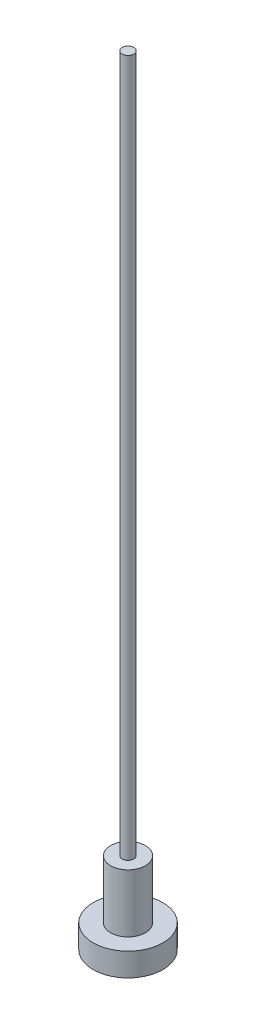
ISO-10303-21;
HEADER;
FILE_DESCRIPTION(('STEP AP214'),'2;1');
FILE_NAME('part.step','',(''),(''),'','','');
FILE_SCHEMA(('AUTOMOTIVE_DESIGN { 1 0 10303 214 1 1 1 1 }'));
ENDSEC;
DATA;
#1=APPLICATION_CONTEXT('core data for automotive mechanical design processes');
#2=APPLICATION_PROTOCOL_DEFINITION('international standard','automotive_design',2000,#1);
#3=PRODUCT_CONTEXT('',#1,'mechanical');
#4=PRODUCT('Part','Part','',(#3));
#5=PRODUCT_RELATED_PRODUCT_CATEGORY('part','',(#4));
#6=PRODUCT_DEFINITION_FORMATION('','',#4);
#7=PRODUCT_DEFINITION_CONTEXT('part definition',#1,'design');
#8=PRODUCT_DEFINITION('design','',#6,#7);
#9=PRODUCT_DEFINITION_SHAPE('','',#8);
#10=(LENGTH_UNIT() NAMED_UNIT(*) SI_UNIT(.MILLI.,.METRE.));
#11=(NAMED_UNIT(*) PLANE_ANGLE_UNIT() SI_UNIT($,.RADIAN.));
#12=(NAMED_UNIT(*) SI_UNIT($,.STERADIAN.) SOLID_ANGLE_UNIT());
#13=UNCERTAINTY_MEASURE_WITH_UNIT(LENGTH_MEASURE(1.E-05),#10,'distance_accuracy_value','');
#14=(GEOMETRIC_REPRESENTATION_CONTEXT(3) GLOBAL_UNCERTAINTY_ASSIGNED_CONTEXT((#13)) GLOBAL_UNIT_ASSIGNED_CONTEXT((#10,
#11,#12)) REPRESENTATION_CONTEXT('',''));
#15=CARTESIAN_POINT('',(0.,0.,0.));
#16=DIRECTION('',(0.,0.,1.));
#17=DIRECTION('',(1.,0.,0.));
#18=AXIS2_PLACEMENT_3D('',#15,#16,#17);
#19=CARTESIAN_POINT('',(0.,5.,0.));
#20=DIRECTION('',(0.,-1.,0.));
#21=DIRECTION('',(0.,0.,-1.));
#22=AXIS2_PLACEMENT_3D('',#19,#20,#21);
#23=CYLINDRICAL_SURFACE('',#22,1.5);
#24=CARTESIAN_POINT('',(0.,5.,0.));
#25=DIRECTION('',(0.,1.,0.));
#26=DIRECTION('',(0.,0.,1.));
#27=AXIS2_PLACEMENT_3D('',#24,#25,#26);
#28=CIRCLE('',#27,1.5);
#29=CARTESIAN_POINT('',(0.,5.,1.5));
#30=VERTEX_POINT('',#29);
#31=EDGE_CURVE('E49',#30,#30,#28,.T.);
#32=ORIENTED_EDGE('',*,*,#31,.F.);
#33=EDGE_LOOP('',(#32));
#34=FACE_BOUND('',#33,.T.);
#35=CARTESIAN_POINT('',(0.,0.,0.));
#36=DIRECTION('',(0.,1.,0.));
#37=DIRECTION('',(0.,0.,1.));
#38=AXIS2_PLACEMENT_3D('',#35,#36,#37);
#39=CIRCLE('',#38,1.5);
#40=CARTESIAN_POINT('',(0.,0.,1.5));
#41=VERTEX_POINT('',#40);
#42=EDGE_CURVE('E44',#41,#41,#39,.T.);
#43=ORIENTED_EDGE('',*,*,#42,.T.);
#44=EDGE_LOOP('',(#43));
#45=FACE_BOUND('',#44,.T.);
#46=ADVANCED_FACE('F41',(#34,#45),#23,.T.);
#47=CARTESIAN_POINT('',(0.,5.,0.));
#48=DIRECTION('',(0.,1.,0.));
#49=DIRECTION('',(0.,0.,1.));
#50=AXIS2_PLACEMENT_3D('',#47,#48,#49);
#51=PLANE('',#50);
#52=CARTESIAN_POINT('',(0.,5.,0.));
#53=DIRECTION('',(0.,1.,0.));
#54=DIRECTION('',(0.,0.,1.));
#55=AXIS2_PLACEMENT_3D('',#52,#53,#54);
#56=CIRCLE('',#55,0.5);
#57=CARTESIAN_POINT('',(0.,5.,0.5));
#58=VERTEX_POINT('',#57);
#59=EDGE_CURVE('E10',#58,#58,#56,.T.);
#60=ORIENTED_EDGE('',*,*,#59,.F.);
#61=EDGE_LOOP('',(#60));
#62=FACE_BOUND('',#61,.T.);
#63=ORIENTED_EDGE('',*,*,#31,.T.);
#64=EDGE_LOOP('',(#63));
#65=FACE_BOUND('',#64,.T.);
#66=ADVANCED_FACE('F95',(#62,#65),#51,.T.);
#67=CARTESIAN_POINT('',(0.,65.,0.));
#68=DIRECTION('',(0.,-1.,0.));
#69=DIRECTION('',(0.,0.,-1.));
#70=AXIS2_PLACEMENT_3D('',#67,#68,#69);
#71=CYLINDRICAL_SURFACE('',#70,0.5);
#72=CARTESIAN_POINT('',(0.,65.,0.));
#73=DIRECTION('',(0.,1.,0.));
#74=DIRECTION('',(0.,0.,1.));
#75=AXIS2_PLACEMENT_3D('',#72,#73,#74);
#76=CIRCLE('',#75,0.5);
#77=CARTESIAN_POINT('',(0.,65.,0.5));
#78=VERTEX_POINT('',#77);
#79=EDGE_CURVE('E55',#78,#78,#76,.T.);
#80=ORIENTED_EDGE('',*,*,#79,.F.);
#81=EDGE_LOOP('',(#80));
#82=FACE_BOUND('',#81,.T.);
#83=ORIENTED_EDGE('',*,*,#59,.T.);
#84=EDGE_LOOP('',(#83));
#85=FACE_BOUND('',#84,.T.);
#86=ADVANCED_FACE('F91',(#82,#85),#71,.T.);
#87=CARTESIAN_POINT('',(0.,65.,0.));
#88=DIRECTION('',(0.,1.,0.));
#89=DIRECTION('',(0.,0.,1.));
#90=AXIS2_PLACEMENT_3D('',#87,#88,#89);
#91=PLANE('',#90);
#92=ORIENTED_EDGE('',*,*,#79,.T.);
#93=EDGE_LOOP('',(#92));
#94=FACE_BOUND('',#93,.T.);
#95=ADVANCED_FACE('F83',(#94),#91,.T.);
#96=CARTESIAN_POINT('',(0.,-2.,0.));
#97=DIRECTION('',(0.,1.,0.));
#98=DIRECTION('',(0.,0.,1.));
#99=AXIS2_PLACEMENT_3D('',#96,#97,#98);
#100=CYLINDRICAL_SURFACE('',#99,3.);
#101=CARTESIAN_POINT('',(0.,-2.,0.));
#102=DIRECTION('',(0.,-1.,0.));
#103=DIRECTION('',(0.,0.,-1.));
#104=AXIS2_PLACEMENT_3D('',#101,#102,#103);
#105=CIRCLE('',#104,3.);
#106=CARTESIAN_POINT('',(0.,-2.,-3.));
#107=VERTEX_POINT('',#106);
#108=EDGE_CURVE('E64',#107,#107,#105,.T.);
#109=ORIENTED_EDGE('',*,*,#108,.F.);
#110=EDGE_LOOP('',(#109));
#111=FACE_BOUND('',#110,.T.);
#112=CARTESIAN_POINT('',(0.,0.,0.));
#113=DIRECTION('',(0.,-1.,0.));
#114=DIRECTION('',(0.,0.,-1.));
#115=AXIS2_PLACEMENT_3D('',#112,#113,#114);
#116=CIRCLE('',#115,3.);
#117=CARTESIAN_POINT('',(0.,0.,-3.));
#118=VERTEX_POINT('',#117);
#119=EDGE_CURVE('E60',#118,#118,#116,.T.);
#120=ORIENTED_EDGE('',*,*,#119,.T.);
#121=EDGE_LOOP('',(#120));
#122=FACE_BOUND('',#121,.T.);
#123=ADVANCED_FACE('F81',(#111,#122),#100,.T.);
#124=CARTESIAN_POINT('',(0.,-2.,0.));
#125=DIRECTION('',(0.,-1.,0.));
#126=DIRECTION('',(0.,0.,-1.));
#127=AXIS2_PLACEMENT_3D('',#124,#125,#126);
#128=PLANE('',#127);
#129=ORIENTED_EDGE('',*,*,#108,.T.);
#130=EDGE_LOOP('',(#129));
#131=FACE_BOUND('',#130,.T.);
#132=ADVANCED_FACE('F77',(#131),#128,.T.);
#133=CARTESIAN_POINT('',(0.,0.,0.));
#134=DIRECTION('',(0.,-1.,0.));
#135=DIRECTION('',(0.,0.,-1.));
#136=AXIS2_PLACEMENT_3D('',#133,#134,#135);
#137=PLANE('',#136);
#138=ORIENTED_EDGE('',*,*,#42,.F.);
#139=EDGE_LOOP('',(#138));
#140=FACE_BOUND('',#139,.T.);
#141=ORIENTED_EDGE('',*,*,#119,.F.);
#142=EDGE_LOOP('',(#141));
#143=FACE_BOUND('',#142,.T.);
#144=ADVANCED_FACE('F74',(#140,#143),#137,.F.);
#145=CLOSED_SHELL('',(#46,#66,#86,#95,#123,#132,#144));
#146=MANIFOLD_SOLID_BREP('B2',#145);
#147=ADVANCED_BREP_SHAPE_REPRESENTATION('',(#18,#146),#14);
#148=SHAPE_DEFINITION_REPRESENTATION(#9,#147);
ENDSEC;
END-ISO-10303-21;
